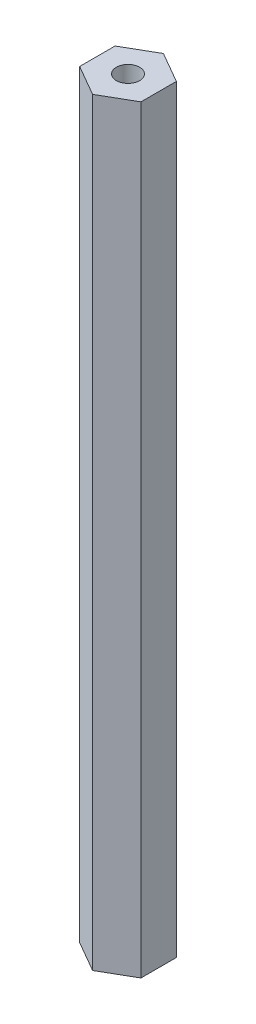
ISO-10303-21;
HEADER;
FILE_DESCRIPTION(('STEP AP214'),'2;1');
FILE_NAME('part.step','',(''),(''),'','','');
FILE_SCHEMA(('AUTOMOTIVE_DESIGN { 1 0 10303 214 1 1 1 1 }'));
ENDSEC;
DATA;
#1=APPLICATION_CONTEXT('core data for automotive mechanical design processes');
#2=APPLICATION_PROTOCOL_DEFINITION('international standard','automotive_design',2000,#1);
#3=PRODUCT_CONTEXT('',#1,'mechanical');
#4=PRODUCT('Part','Part','',(#3));
#5=PRODUCT_RELATED_PRODUCT_CATEGORY('part','',(#4));
#6=PRODUCT_DEFINITION_FORMATION('','',#4);
#7=PRODUCT_DEFINITION_CONTEXT('part definition',#1,'design');
#8=PRODUCT_DEFINITION('design','',#6,#7);
#9=PRODUCT_DEFINITION_SHAPE('','',#8);
#10=(LENGTH_UNIT() NAMED_UNIT(*) SI_UNIT(.MILLI.,.METRE.));
#11=(NAMED_UNIT(*) PLANE_ANGLE_UNIT() SI_UNIT($,.RADIAN.));
#12=(NAMED_UNIT(*) SI_UNIT($,.STERADIAN.) SOLID_ANGLE_UNIT());
#13=UNCERTAINTY_MEASURE_WITH_UNIT(LENGTH_MEASURE(1.E-05),#10,'distance_accuracy_value','');
#14=(GEOMETRIC_REPRESENTATION_CONTEXT(3) GLOBAL_UNCERTAINTY_ASSIGNED_CONTEXT((#13)) GLOBAL_UNIT_ASSIGNED_CONTEXT((#10,
#11,#12)) REPRESENTATION_CONTEXT('',''));
#15=CARTESIAN_POINT('',(0.,0.,0.));
#16=DIRECTION('',(0.,0.,1.));
#17=DIRECTION('',(1.,0.,0.));
#18=AXIS2_PLACEMENT_3D('',#15,#16,#17);
#19=CARTESIAN_POINT('',(6.34999999999995,157.1625,-3.66617420935419));
#20=DIRECTION('',(-0.499999999999995,0.,0.866025403784441));
#21=DIRECTION('',(0.866025403784442,0.,0.499999999999995));
#22=AXIS2_PLACEMENT_3D('',#19,#20,#21);
#23=PLANE('',#22);
#24=DIRECTION('',(-0.866025403784441,0.,-0.499999999999995));
#25=VECTOR('',#24,1.);
#26=CARTESIAN_POINT('',(6.34999999999995,0.,-3.66617420935419));
#27=LINE('',#26,#25);
#28=CARTESIAN_POINT('',(6.34999999999995,0.,-3.66617420935419));
#29=VERTEX_POINT('',#28);
#30=CARTESIAN_POINT('',(0.,0.,-7.33234841870824));
#31=VERTEX_POINT('',#30);
#32=EDGE_CURVE('E119',#29,#31,#27,.T.);
#33=ORIENTED_EDGE('',*,*,#32,.T.);
#34=DIRECTION('',(0.,-1.,0.));
#35=VECTOR('',#34,1.);
#36=CARTESIAN_POINT('',(0.,157.1625,-7.33234841870824));
#37=LINE('',#36,#35);
#38=CARTESIAN_POINT('',(0.,157.1625,-7.33234841870824));
#39=VERTEX_POINT('',#38);
#40=EDGE_CURVE('E11',#39,#31,#37,.T.);
#41=ORIENTED_EDGE('',*,*,#40,.F.);
#42=DIRECTION('',(-0.866025403784441,0.,-0.499999999999995));
#43=VECTOR('',#42,1.);
#44=CARTESIAN_POINT('',(6.34999999999995,157.1625,-3.66617420935419));
#45=LINE('',#44,#43);
#46=CARTESIAN_POINT('',(6.34999999999995,157.1625,-3.66617420935419));
#47=VERTEX_POINT('',#46);
#48=EDGE_CURVE('E130',#47,#39,#45,.T.);
#49=ORIENTED_EDGE('',*,*,#48,.F.);
#50=DIRECTION('',(0.,-1.,0.));
#51=VECTOR('',#50,1.);
#52=CARTESIAN_POINT('',(6.34999999999995,157.1625,-3.66617420935419));
#53=LINE('',#52,#51);
#54=EDGE_CURVE('E115',#47,#29,#53,.T.);
#55=ORIENTED_EDGE('',*,*,#54,.T.);
#56=EDGE_LOOP('',(#33,#41,#49,#55));
#57=FACE_BOUND('',#56,.T.);
#58=ADVANCED_FACE('F32',(#57),#23,.F.);
#59=CARTESIAN_POINT('',(0.,157.1625,-7.33234841870824));
#60=DIRECTION('',(0.500000000000001,0.,0.866025403784438));
#61=DIRECTION('',(0.866025403784438,0.,-0.500000000000001));
#62=AXIS2_PLACEMENT_3D('',#59,#60,#61);
#63=PLANE('',#62);
#64=DIRECTION('',(-0.866025403784438,0.,0.500000000000001));
#65=VECTOR('',#64,1.);
#66=CARTESIAN_POINT('',(0.,0.,-7.33234841870824));
#67=LINE('',#66,#65);
#68=CARTESIAN_POINT('',(-6.35,0.,-3.6661742093541));
#69=VERTEX_POINT('',#68);
#70=EDGE_CURVE('E122',#31,#69,#67,.T.);
#71=ORIENTED_EDGE('',*,*,#70,.T.);
#72=DIRECTION('',(0.,-1.,0.));
#73=VECTOR('',#72,1.);
#74=CARTESIAN_POINT('',(-6.35,157.1625,-3.6661742093541));
#75=LINE('',#74,#73);
#76=CARTESIAN_POINT('',(-6.35,157.1625,-3.6661742093541));
#77=VERTEX_POINT('',#76);
#78=EDGE_CURVE('E40',#77,#69,#75,.T.);
#79=ORIENTED_EDGE('',*,*,#78,.F.);
#80=DIRECTION('',(-0.866025403784438,0.,0.500000000000001));
#81=VECTOR('',#80,1.);
#82=CARTESIAN_POINT('',(0.,157.1625,-7.33234841870824));
#83=LINE('',#82,#81);
#84=EDGE_CURVE('E86',#39,#77,#83,.T.);
#85=ORIENTED_EDGE('',*,*,#84,.F.);
#86=ORIENTED_EDGE('',*,*,#40,.T.);
#87=EDGE_LOOP('',(#71,#79,#85,#86));
#88=FACE_BOUND('',#87,.T.);
#89=ADVANCED_FACE('F155',(#88),#63,.F.);
#90=CARTESIAN_POINT('',(-6.35,157.1625,-3.6661742093541));
#91=DIRECTION('',(1.,0.,0.));
#92=DIRECTION('',(0.,0.,-1.));
#93=AXIS2_PLACEMENT_3D('',#90,#91,#92);
#94=PLANE('',#93);
#95=DIRECTION('',(0.,0.,1.));
#96=VECTOR('',#95,1.);
#97=CARTESIAN_POINT('',(-6.35,0.,-3.6661742093541));
#98=LINE('',#97,#96);
#99=CARTESIAN_POINT('',(-6.34999999999997,0.,3.66617420935415));
#100=VERTEX_POINT('',#99);
#101=EDGE_CURVE('E125',#69,#100,#98,.T.);
#102=ORIENTED_EDGE('',*,*,#101,.T.);
#103=DIRECTION('',(0.,-1.,0.));
#104=VECTOR('',#103,1.);
#105=CARTESIAN_POINT('',(-6.34999999999997,157.1625,3.66617420935415));
#106=LINE('',#105,#104);
#107=CARTESIAN_POINT('',(-6.34999999999997,157.1625,3.66617420935415));
#108=VERTEX_POINT('',#107);
#109=EDGE_CURVE('E110',#108,#100,#106,.T.);
#110=ORIENTED_EDGE('',*,*,#109,.F.);
#111=DIRECTION('',(0.,0.,1.));
#112=VECTOR('',#111,1.);
#113=CARTESIAN_POINT('',(-6.35,157.1625,-3.6661742093541));
#114=LINE('',#113,#112);
#115=EDGE_CURVE('E101',#77,#108,#114,.T.);
#116=ORIENTED_EDGE('',*,*,#115,.F.);
#117=ORIENTED_EDGE('',*,*,#78,.T.);
#118=EDGE_LOOP('',(#102,#110,#116,#117));
#119=FACE_BOUND('',#118,.T.);
#120=ADVANCED_FACE('F136',(#119),#94,.F.);
#121=CARTESIAN_POINT('',(-6.34999999999997,157.1625,3.66617420935415));
#122=DIRECTION('',(0.499999999999995,0.,-0.866025403784442));
#123=DIRECTION('',(-0.866025403784442,0.,-0.499999999999995));
#124=AXIS2_PLACEMENT_3D('',#121,#122,#123);
#125=PLANE('',#124);
#126=DIRECTION('',(0.866025403784441,0.,0.499999999999995));
#127=VECTOR('',#126,1.);
#128=CARTESIAN_POINT('',(-6.34999999999997,0.,3.66617420935415));
#129=LINE('',#128,#127);
#130=CARTESIAN_POINT('',(0.,0.,7.33234841870824));
#131=VERTEX_POINT('',#130);
#132=EDGE_CURVE('E109',#100,#131,#129,.T.);
#133=ORIENTED_EDGE('',*,*,#132,.T.);
#134=DIRECTION('',(0.,-1.,0.));
#135=VECTOR('',#134,1.);
#136=CARTESIAN_POINT('',(0.,157.1625,7.33234841870824));
#137=LINE('',#136,#135);
#138=CARTESIAN_POINT('',(0.,157.1625,7.33234841870824));
#139=VERTEX_POINT('',#138);
#140=EDGE_CURVE('E106',#139,#131,#137,.T.);
#141=ORIENTED_EDGE('',*,*,#140,.F.);
#142=DIRECTION('',(0.866025403784441,0.,0.499999999999995));
#143=VECTOR('',#142,1.);
#144=CARTESIAN_POINT('',(-6.34999999999997,157.1625,3.66617420935415));
#145=LINE('',#144,#143);
#146=EDGE_CURVE('E95',#108,#139,#145,.T.);
#147=ORIENTED_EDGE('',*,*,#146,.F.);
#148=ORIENTED_EDGE('',*,*,#109,.T.);
#149=EDGE_LOOP('',(#133,#141,#147,#148));
#150=FACE_BOUND('',#149,.T.);
#151=ADVANCED_FACE('F107',(#150),#125,.F.);
#152=CARTESIAN_POINT('',(0.,157.1625,7.33234841870824));
#153=DIRECTION('',(-0.500000000000007,0.,-0.866025403784434));
#154=DIRECTION('',(-0.866025403784435,0.,0.500000000000007));
#155=AXIS2_PLACEMENT_3D('',#152,#153,#154);
#156=PLANE('',#155);
#157=DIRECTION('',(0.866025403784435,0.,-0.500000000000007));
#158=VECTOR('',#157,1.);
#159=CARTESIAN_POINT('',(0.,0.,7.33234841870824));
#160=LINE('',#159,#158);
#161=CARTESIAN_POINT('',(6.35000000000002,0.,3.66617420935406));
#162=VERTEX_POINT('',#161);
#163=EDGE_CURVE('E72',#131,#162,#160,.T.);
#164=ORIENTED_EDGE('',*,*,#163,.T.);
#165=DIRECTION('',(0.,-1.,0.));
#166=VECTOR('',#165,1.);
#167=CARTESIAN_POINT('',(6.35000000000002,157.1625,3.66617420935406));
#168=LINE('',#167,#166);
#169=CARTESIAN_POINT('',(6.35000000000002,157.1625,3.66617420935406));
#170=VERTEX_POINT('',#169);
#171=EDGE_CURVE('E111',#170,#162,#168,.T.);
#172=ORIENTED_EDGE('',*,*,#171,.F.);
#173=DIRECTION('',(0.866025403784435,0.,-0.500000000000007));
#174=VECTOR('',#173,1.);
#175=CARTESIAN_POINT('',(0.,157.1625,7.33234841870824));
#176=LINE('',#175,#174);
#177=EDGE_CURVE('E99',#139,#170,#176,.T.);
#178=ORIENTED_EDGE('',*,*,#177,.F.);
#179=ORIENTED_EDGE('',*,*,#140,.T.);
#180=EDGE_LOOP('',(#164,#172,#178,#179));
#181=FACE_BOUND('',#180,.T.);
#182=ADVANCED_FACE('F113',(#181),#156,.F.);
#183=CARTESIAN_POINT('',(6.35000000000002,157.1625,3.66617420935406));
#184=DIRECTION('',(-1.,0.,0.));
#185=DIRECTION('',(0.,0.,1.));
#186=AXIS2_PLACEMENT_3D('',#183,#184,#185);
#187=PLANE('',#186);
#188=DIRECTION('',(0.,0.,-1.));
#189=VECTOR('',#188,1.);
#190=CARTESIAN_POINT('',(6.35000000000002,0.,3.66617420935406));
#191=LINE('',#190,#189);
#192=EDGE_CURVE('E78',#162,#29,#191,.T.);
#193=ORIENTED_EDGE('',*,*,#192,.T.);
#194=ORIENTED_EDGE('',*,*,#54,.F.);
#195=DIRECTION('',(0.,0.,-1.));
#196=VECTOR('',#195,1.);
#197=CARTESIAN_POINT('',(6.35000000000002,157.1625,3.66617420935406));
#198=LINE('',#197,#196);
#199=EDGE_CURVE('E48',#170,#47,#198,.T.);
#200=ORIENTED_EDGE('',*,*,#199,.F.);
#201=ORIENTED_EDGE('',*,*,#171,.T.);
#202=EDGE_LOOP('',(#193,#194,#200,#201));
#203=FACE_BOUND('',#202,.T.);
#204=ADVANCED_FACE('F143',(#203),#187,.F.);
#205=CARTESIAN_POINT('',(0.,157.1625,0.));
#206=DIRECTION('',(0.,1.,0.));
#207=DIRECTION('',(0.,0.,1.));
#208=AXIS2_PLACEMENT_3D('',#205,#206,#207);
#209=PLANE('',#208);
#210=CARTESIAN_POINT('',(0.,157.1625,0.));
#211=DIRECTION('',(0.,1.,0.));
#212=DIRECTION('',(0.,0.,1.));
#213=AXIS2_PLACEMENT_3D('',#210,#211,#212);
#214=CIRCLE('',#213,2.413);
#215=CARTESIAN_POINT('',(0.,157.1625,2.41300000000002));
#216=VERTEX_POINT('',#215);
#217=EDGE_CURVE('E281',#216,#216,#214,.T.);
#218=ORIENTED_EDGE('',*,*,#217,.F.);
#219=EDGE_LOOP('',(#218));
#220=FACE_BOUND('',#219,.T.);
#221=ORIENTED_EDGE('',*,*,#48,.T.);
#222=ORIENTED_EDGE('',*,*,#84,.T.);
#223=ORIENTED_EDGE('',*,*,#115,.T.);
#224=ORIENTED_EDGE('',*,*,#146,.T.);
#225=ORIENTED_EDGE('',*,*,#177,.T.);
#226=ORIENTED_EDGE('',*,*,#199,.T.);
#227=EDGE_LOOP('',(#221,#222,#223,#224,#225,#226));
#228=FACE_BOUND('',#227,.T.);
#229=ADVANCED_FACE('F97',(#220,#228),#209,.T.);
#230=CARTESIAN_POINT('',(0.,0.,0.));
#231=DIRECTION('',(0.,1.,0.));
#232=DIRECTION('',(0.,0.,1.));
#233=AXIS2_PLACEMENT_3D('',#230,#231,#232);
#234=PLANE('',#233);
#235=CARTESIAN_POINT('',(0.,0.,0.));
#236=DIRECTION('',(0.,-1.,0.));
#237=DIRECTION('',(0.,0.,-1.));
#238=AXIS2_PLACEMENT_3D('',#235,#236,#237);
#239=CIRCLE('',#238,2.413);
#240=CARTESIAN_POINT('',(0.,0.,-2.413));
#241=VERTEX_POINT('',#240);
#242=EDGE_CURVE('E291',#241,#241,#239,.T.);
#243=ORIENTED_EDGE('',*,*,#242,.F.);
#244=EDGE_LOOP('',(#243));
#245=FACE_BOUND('',#244,.T.);
#246=ORIENTED_EDGE('',*,*,#32,.F.);
#247=ORIENTED_EDGE('',*,*,#192,.F.);
#248=ORIENTED_EDGE('',*,*,#163,.F.);
#249=ORIENTED_EDGE('',*,*,#132,.F.);
#250=ORIENTED_EDGE('',*,*,#101,.F.);
#251=ORIENTED_EDGE('',*,*,#70,.F.);
#252=EDGE_LOOP('',(#246,#247,#248,#249,#250,#251));
#253=FACE_BOUND('',#252,.T.);
#254=ADVANCED_FACE('F139',(#245,#253),#234,.F.);
#255=CARTESIAN_POINT('',(0.,16.764,0.));
#256=DIRECTION('',(0.,-1.,0.));
#257=DIRECTION('',(0.,0.,-1.));
#258=AXIS2_PLACEMENT_3D('',#255,#256,#257);
#259=CONICAL_SURFACE('',#258,2.0193,1.02974425867665);
#260=CARTESIAN_POINT('',(0.,17.9773178480024,0.));
#261=VERTEX_POINT('',#260);
#262=VERTEX_LOOP('',#261);
#263=FACE_BOUND('',#262,.T.);
#264=CARTESIAN_POINT('',(0.,16.764,0.));
#265=DIRECTION('',(0.,-1.,0.));
#266=DIRECTION('',(0.,0.,-1.));
#267=AXIS2_PLACEMENT_3D('',#264,#265,#266);
#268=CIRCLE('',#267,2.0193);
#269=CARTESIAN_POINT('',(0.,16.764,-2.0193));
#270=VERTEX_POINT('',#269);
#271=EDGE_CURVE('E123',#270,#270,#268,.T.);
#272=ORIENTED_EDGE('',*,*,#271,.T.);
#273=EDGE_LOOP('',(#272));
#274=FACE_BOUND('',#273,.T.);
#275=ADVANCED_FACE('F192',(#263,#274),#259,.F.);
#276=CARTESIAN_POINT('',(0.,0.,0.));
#277=DIRECTION('',(0.,-1.,0.));
#278=DIRECTION('',(0.,0.,-1.));
#279=AXIS2_PLACEMENT_3D('',#276,#277,#278);
#280=CYLINDRICAL_SURFACE('',#279,2.0193);
#281=ORIENTED_EDGE('',*,*,#271,.F.);
#282=EDGE_LOOP('',(#281));
#283=FACE_BOUND('',#282,.T.);
#284=CARTESIAN_POINT('',(0.,12.7,0.));
#285=DIRECTION('',(0.,-1.,0.));
#286=DIRECTION('',(0.,0.,-1.));
#287=AXIS2_PLACEMENT_3D('',#284,#285,#286);
#288=CIRCLE('',#287,2.0193);
#289=CARTESIAN_POINT('',(0.,12.7,-2.0193));
#290=VERTEX_POINT('',#289);
#291=EDGE_CURVE('E297',#290,#290,#288,.T.);
#292=ORIENTED_EDGE('',*,*,#291,.T.);
#293=EDGE_LOOP('',(#292));
#294=FACE_BOUND('',#293,.T.);
#295=ADVANCED_FACE('F201',(#283,#294),#280,.F.);
#296=CARTESIAN_POINT('',(2.0193,12.7,0.));
#297=DIRECTION('',(0.,1.,0.));
#298=DIRECTION('',(0.,0.,1.));
#299=AXIS2_PLACEMENT_3D('',#296,#297,#298);
#300=PLANE('',#299);
#301=ORIENTED_EDGE('',*,*,#291,.F.);
#302=EDGE_LOOP('',(#301));
#303=FACE_BOUND('',#302,.T.);
#304=CARTESIAN_POINT('',(0.,12.7,0.));
#305=DIRECTION('',(0.,-1.,0.));
#306=DIRECTION('',(0.,0.,-1.));
#307=AXIS2_PLACEMENT_3D('',#304,#305,#306);
#308=CIRCLE('',#307,2.41299999999999);
#309=CARTESIAN_POINT('',(0.,12.7,-2.41299999999999));
#310=VERTEX_POINT('',#309);
#311=EDGE_CURVE('E294',#310,#310,#308,.T.);
#312=ORIENTED_EDGE('',*,*,#311,.T.);
#313=EDGE_LOOP('',(#312));
#314=FACE_BOUND('',#313,.T.);
#315=ADVANCED_FACE('F211',(#303,#314),#300,.F.);
#316=CARTESIAN_POINT('',(0.,0.,0.));
#317=DIRECTION('',(0.,-1.,0.));
#318=DIRECTION('',(0.,0.,-1.));
#319=AXIS2_PLACEMENT_3D('',#316,#317,#318);
#320=CYLINDRICAL_SURFACE('',#319,2.41299999999999);
#321=ORIENTED_EDGE('',*,*,#311,.F.);
#322=EDGE_LOOP('',(#321));
#323=FACE_BOUND('',#322,.T.);
#324=ORIENTED_EDGE('',*,*,#242,.T.);
#325=EDGE_LOOP('',(#324));
#326=FACE_BOUND('',#325,.T.);
#327=ADVANCED_FACE('F221',(#323,#326),#320,.F.);
#328=CARTESIAN_POINT('',(0.,140.3985,0.));
#329=DIRECTION('',(0.,1.,0.));
#330=DIRECTION('',(0.,0.,1.));
#331=AXIS2_PLACEMENT_3D('',#328,#329,#330);
#332=CONICAL_SURFACE('',#331,2.0193,1.02974425867665);
#333=CARTESIAN_POINT('',(0.,139.185182151998,0.));
#334=VERTEX_POINT('',#333);
#335=VERTEX_LOOP('',#334);
#336=FACE_BOUND('',#335,.T.);
#337=CARTESIAN_POINT('',(0.,140.3985,0.));
#338=DIRECTION('',(0.,1.,0.));
#339=DIRECTION('',(0.,0.,1.));
#340=AXIS2_PLACEMENT_3D('',#337,#338,#339);
#341=CIRCLE('',#340,2.0193);
#342=CARTESIAN_POINT('',(0.,140.3985,2.01930000000002));
#343=VERTEX_POINT('',#342);
#344=EDGE_CURVE('E288',#343,#343,#341,.T.);
#345=ORIENTED_EDGE('',*,*,#344,.T.);
#346=EDGE_LOOP('',(#345));
#347=FACE_BOUND('',#346,.T.);
#348=ADVANCED_FACE('F231',(#336,#347),#332,.F.);
#349=CARTESIAN_POINT('',(0.,157.1625,0.));
#350=DIRECTION('',(0.,1.,0.));
#351=DIRECTION('',(0.,0.,1.));
#352=AXIS2_PLACEMENT_3D('',#349,#350,#351);
#353=CYLINDRICAL_SURFACE('',#352,2.0193);
#354=ORIENTED_EDGE('',*,*,#344,.F.);
#355=EDGE_LOOP('',(#354));
#356=FACE_BOUND('',#355,.T.);
#357=CARTESIAN_POINT('',(0.,144.4625,0.));
#358=DIRECTION('',(0.,1.,0.));
#359=DIRECTION('',(0.,0.,1.));
#360=AXIS2_PLACEMENT_3D('',#357,#358,#359);
#361=CIRCLE('',#360,2.0193);
#362=CARTESIAN_POINT('',(0.,144.4625,2.01930000000002));
#363=VERTEX_POINT('',#362);
#364=EDGE_CURVE('E283',#363,#363,#361,.T.);
#365=ORIENTED_EDGE('',*,*,#364,.T.);
#366=EDGE_LOOP('',(#365));
#367=FACE_BOUND('',#366,.T.);
#368=ADVANCED_FACE('F241',(#356,#367),#353,.F.);
#369=CARTESIAN_POINT('',(2.01929999999999,144.4625,0.));
#370=DIRECTION('',(0.,-1.,0.));
#371=DIRECTION('',(0.,0.,-1.));
#372=AXIS2_PLACEMENT_3D('',#369,#370,#371);
#373=PLANE('',#372);
#374=ORIENTED_EDGE('',*,*,#364,.F.);
#375=EDGE_LOOP('',(#374));
#376=FACE_BOUND('',#375,.T.);
#377=CARTESIAN_POINT('',(0.,144.4625,0.));
#378=DIRECTION('',(0.,1.,0.));
#379=DIRECTION('',(0.,0.,1.));
#380=AXIS2_PLACEMENT_3D('',#377,#378,#379);
#381=CIRCLE('',#380,2.41299999999999);
#382=CARTESIAN_POINT('',(0.,144.4625,2.41300000000001));
#383=VERTEX_POINT('',#382);
#384=EDGE_CURVE('E278',#383,#383,#381,.T.);
#385=ORIENTED_EDGE('',*,*,#384,.T.);
#386=EDGE_LOOP('',(#385));
#387=FACE_BOUND('',#386,.T.);
#388=ADVANCED_FACE('F251',(#376,#387),#373,.F.);
#389=CARTESIAN_POINT('',(0.,157.1625,0.));
#390=DIRECTION('',(0.,1.,0.));
#391=DIRECTION('',(0.,0.,1.));
#392=AXIS2_PLACEMENT_3D('',#389,#390,#391);
#393=CYLINDRICAL_SURFACE('',#392,2.41299999999999);
#394=ORIENTED_EDGE('',*,*,#384,.F.);
#395=EDGE_LOOP('',(#394));
#396=FACE_BOUND('',#395,.T.);
#397=ORIENTED_EDGE('',*,*,#217,.T.);
#398=EDGE_LOOP('',(#397));
#399=FACE_BOUND('',#398,.T.);
#400=ADVANCED_FACE('F261',(#396,#399),#393,.F.);
#401=CLOSED_SHELL('',(#58,#89,#120,#151,#182,#204,#229,#254,#275,#295,#315,#327,#348,#368,#388,#400));
#402=MANIFOLD_SOLID_BREP('B2',#401);
#403=ADVANCED_BREP_SHAPE_REPRESENTATION('',(#18,#402),#14);
#404=SHAPE_DEFINITION_REPRESENTATION(#9,#403);
ENDSEC;
END-ISO-10303-21;
